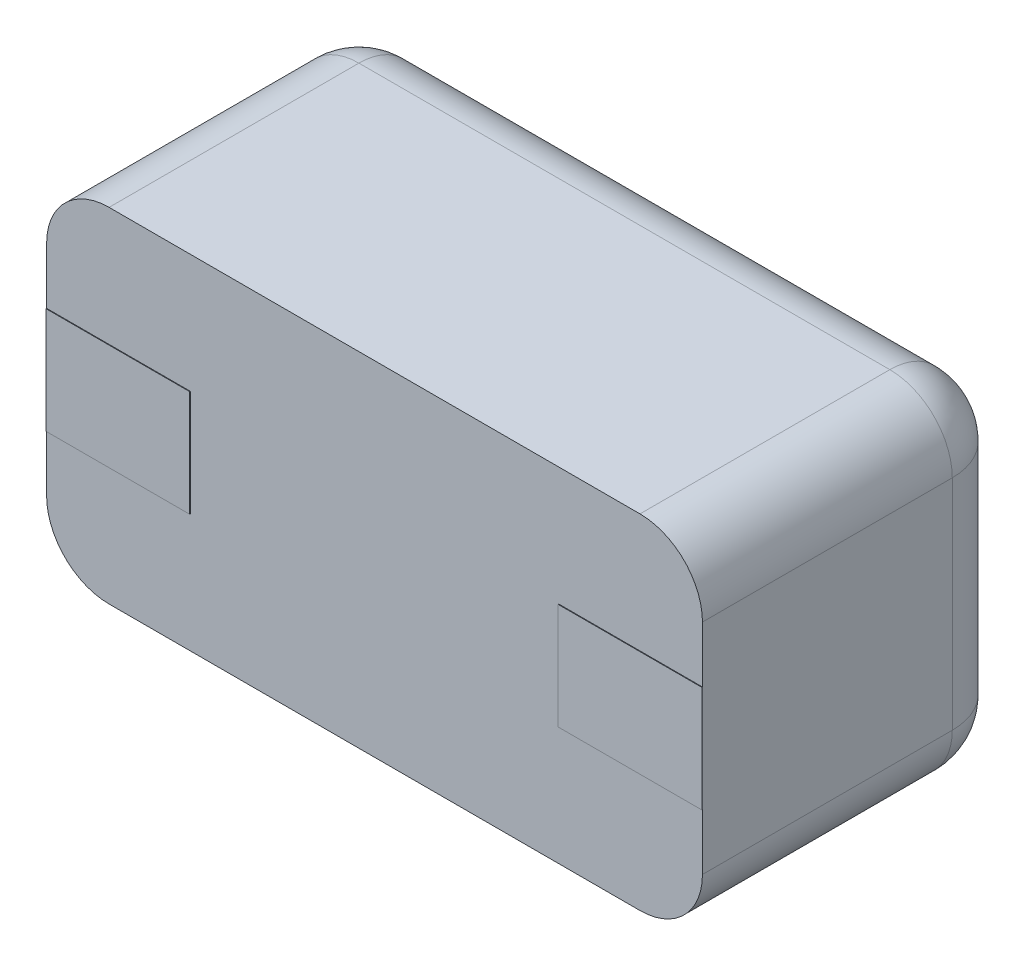
ISO-10303-21;
HEADER;
FILE_DESCRIPTION(('STEP AP214'),'2;1');
FILE_NAME('part.step','',(''),(''),'','','');
FILE_SCHEMA(('AUTOMOTIVE_DESIGN { 1 0 10303 214 1 1 1 1 }'));
ENDSEC;
DATA;
#1=APPLICATION_CONTEXT('core data for automotive mechanical design processes');
#2=APPLICATION_PROTOCOL_DEFINITION('international standard','automotive_design',2000,#1);
#3=PRODUCT_CONTEXT('',#1,'mechanical');
#4=PRODUCT('Part','Part','',(#3));
#5=PRODUCT_RELATED_PRODUCT_CATEGORY('part','',(#4));
#6=PRODUCT_DEFINITION_FORMATION('','',#4);
#7=PRODUCT_DEFINITION_CONTEXT('part definition',#1,'design');
#8=PRODUCT_DEFINITION('design','',#6,#7);
#9=PRODUCT_DEFINITION_SHAPE('','',#8);
#10=(LENGTH_UNIT() NAMED_UNIT(*) SI_UNIT(.MILLI.,.METRE.));
#11=(NAMED_UNIT(*) PLANE_ANGLE_UNIT() SI_UNIT($,.RADIAN.));
#12=(NAMED_UNIT(*) SI_UNIT($,.STERADIAN.) SOLID_ANGLE_UNIT());
#13=UNCERTAINTY_MEASURE_WITH_UNIT(LENGTH_MEASURE(1.E-05),#10,'distance_accuracy_value','');
#14=(GEOMETRIC_REPRESENTATION_CONTEXT(3) GLOBAL_UNCERTAINTY_ASSIGNED_CONTEXT((#13)) GLOBAL_UNIT_ASSIGNED_CONTEXT((#10,
#11,#12)) REPRESENTATION_CONTEXT('',''));
#15=CARTESIAN_POINT('',(0.,0.,0.));
#16=DIRECTION('',(0.,0.,1.));
#17=DIRECTION('',(1.,0.,0.));
#18=AXIS2_PLACEMENT_3D('',#15,#16,#17);
#19=CARTESIAN_POINT('',(8.2,0.,5.01));
#20=DIRECTION('',(-1.,0.,0.));
#21=DIRECTION('',(0.,0.,1.));
#22=AXIS2_PLACEMENT_3D('',#19,#20,#21);
#23=PLANE('',#22);
#24=DIRECTION('',(0.,1.,0.));
#25=VECTOR('',#24,1.);
#26=CARTESIAN_POINT('',(8.2,0.,5.));
#27=LINE('',#26,#25);
#28=CARTESIAN_POINT('',(8.2,1.9,5.));
#29=VERTEX_POINT('',#28);
#30=CARTESIAN_POINT('',(8.2,3.6,5.));
#31=VERTEX_POINT('',#30);
#32=EDGE_CURVE('E113',#29,#31,#27,.T.);
#33=ORIENTED_EDGE('',*,*,#32,.F.);
#34=DIRECTION('',(0.,0.,-1.));
#35=VECTOR('',#34,1.);
#36=CARTESIAN_POINT('',(8.2,1.9,5.01));
#37=LINE('',#36,#35);
#38=CARTESIAN_POINT('',(8.2,1.9,5.01));
#39=VERTEX_POINT('',#38);
#40=EDGE_CURVE('E12',#39,#29,#37,.T.);
#41=ORIENTED_EDGE('',*,*,#40,.F.);
#42=DIRECTION('',(0.,1.,0.));
#43=VECTOR('',#42,1.);
#44=CARTESIAN_POINT('',(8.2,0.,5.01));
#45=LINE('',#44,#43);
#46=CARTESIAN_POINT('',(8.2,3.6,5.01));
#47=VERTEX_POINT('',#46);
#48=EDGE_CURVE('E107',#39,#47,#45,.T.);
#49=ORIENTED_EDGE('',*,*,#48,.T.);
#50=DIRECTION('',(0.,0.,-1.));
#51=VECTOR('',#50,1.);
#52=CARTESIAN_POINT('',(8.2,3.6,5.01));
#53=LINE('',#52,#51);
#54=EDGE_CURVE('E88',#47,#31,#53,.T.);
#55=ORIENTED_EDGE('',*,*,#54,.T.);
#56=EDGE_LOOP('',(#33,#41,#49,#55));
#57=FACE_BOUND('',#56,.T.);
#58=ADVANCED_FACE('F50',(#57),#23,.T.);
#59=CARTESIAN_POINT('',(0.,1.90000000000001,5.01));
#60=DIRECTION('',(0.,-1.,0.));
#61=DIRECTION('',(1.,0.,0.));
#62=AXIS2_PLACEMENT_3D('',#59,#60,#61);
#63=PLANE('',#62);
#64=DIRECTION('',(-1.,0.,0.));
#65=VECTOR('',#64,1.);
#66=CARTESIAN_POINT('',(0.,1.90000000000001,5.));
#67=LINE('',#66,#65);
#68=CARTESIAN_POINT('',(10.5,1.89999999999999,5.));
#69=VERTEX_POINT('',#68);
#70=EDGE_CURVE('E101',#69,#29,#67,.T.);
#71=ORIENTED_EDGE('',*,*,#70,.F.);
#72=DIRECTION('',(0.,0.,-1.));
#73=VECTOR('',#72,1.);
#74=CARTESIAN_POINT('',(10.5,1.89999999999999,5.01));
#75=LINE('',#74,#73);
#76=CARTESIAN_POINT('',(10.5,1.89999999999999,5.01));
#77=VERTEX_POINT('',#76);
#78=EDGE_CURVE('E58',#77,#69,#75,.T.);
#79=ORIENTED_EDGE('',*,*,#78,.F.);
#80=DIRECTION('',(-1.,0.,0.));
#81=VECTOR('',#80,1.);
#82=CARTESIAN_POINT('',(0.,1.90000000000001,5.01));
#83=LINE('',#82,#81);
#84=EDGE_CURVE('E99',#77,#39,#83,.T.);
#85=ORIENTED_EDGE('',*,*,#84,.T.);
#86=ORIENTED_EDGE('',*,*,#40,.T.);
#87=EDGE_LOOP('',(#71,#79,#85,#86));
#88=FACE_BOUND('',#87,.T.);
#89=ADVANCED_FACE('F97',(#88),#63,.T.);
#90=CARTESIAN_POINT('',(10.5,0.,5.01));
#91=DIRECTION('',(-1.,0.,0.));
#92=DIRECTION('',(0.,0.,1.));
#93=AXIS2_PLACEMENT_3D('',#90,#91,#92);
#94=PLANE('',#93);
#95=DIRECTION('',(0.,1.,0.));
#96=VECTOR('',#95,1.);
#97=CARTESIAN_POINT('',(10.5,0.,5.));
#98=LINE('',#97,#96);
#99=CARTESIAN_POINT('',(10.5,3.59999999999999,5.));
#100=VERTEX_POINT('',#99);
#101=EDGE_CURVE('E81',#69,#100,#98,.T.);
#102=ORIENTED_EDGE('',*,*,#101,.T.);
#103=DIRECTION('',(0.,0.,-1.));
#104=VECTOR('',#103,1.);
#105=CARTESIAN_POINT('',(10.5,3.59999999999999,5.01));
#106=LINE('',#105,#104);
#107=CARTESIAN_POINT('',(10.5,3.59999999999999,5.01));
#108=VERTEX_POINT('',#107);
#109=EDGE_CURVE('E102',#108,#100,#106,.T.);
#110=ORIENTED_EDGE('',*,*,#109,.F.);
#111=DIRECTION('',(0.,1.,0.));
#112=VECTOR('',#111,1.);
#113=CARTESIAN_POINT('',(10.5,0.,5.01));
#114=LINE('',#113,#112);
#115=EDGE_CURVE('E103',#77,#108,#114,.T.);
#116=ORIENTED_EDGE('',*,*,#115,.F.);
#117=ORIENTED_EDGE('',*,*,#78,.T.);
#118=EDGE_LOOP('',(#102,#110,#116,#117));
#119=FACE_BOUND('',#118,.T.);
#120=ADVANCED_FACE('F104',(#119),#94,.F.);
#121=CARTESIAN_POINT('',(0.,3.60000000000001,5.01));
#122=DIRECTION('',(0.,-1.,0.));
#123=DIRECTION('',(1.,0.,0.));
#124=AXIS2_PLACEMENT_3D('',#121,#122,#123);
#125=PLANE('',#124);
#126=DIRECTION('',(-1.,0.,0.));
#127=VECTOR('',#126,1.);
#128=CARTESIAN_POINT('',(0.,3.60000000000001,5.));
#129=LINE('',#128,#127);
#130=EDGE_CURVE('E109',#100,#31,#129,.T.);
#131=ORIENTED_EDGE('',*,*,#130,.T.);
#132=ORIENTED_EDGE('',*,*,#54,.F.);
#133=DIRECTION('',(-1.,0.,0.));
#134=VECTOR('',#133,1.);
#135=CARTESIAN_POINT('',(0.,3.60000000000001,5.01));
#136=LINE('',#135,#134);
#137=EDGE_CURVE('E66',#108,#47,#136,.T.);
#138=ORIENTED_EDGE('',*,*,#137,.F.);
#139=ORIENTED_EDGE('',*,*,#109,.T.);
#140=EDGE_LOOP('',(#131,#132,#138,#139));
#141=FACE_BOUND('',#140,.T.);
#142=ADVANCED_FACE('F122',(#141),#125,.F.);
#143=CARTESIAN_POINT('',(0.,0.,5.01));
#144=DIRECTION('',(0.,0.,1.));
#145=DIRECTION('',(1.,0.,0.));
#146=AXIS2_PLACEMENT_3D('',#143,#144,#145);
#147=PLANE('',#146);
#148=ORIENTED_EDGE('',*,*,#48,.F.);
#149=ORIENTED_EDGE('',*,*,#84,.F.);
#150=ORIENTED_EDGE('',*,*,#115,.T.);
#151=ORIENTED_EDGE('',*,*,#137,.T.);
#152=EDGE_LOOP('',(#148,#149,#150,#151));
#153=FACE_BOUND('',#152,.T.);
#154=ADVANCED_FACE('F106',(#153),#147,.T.);
#155=CARTESIAN_POINT('',(0.,0.,5.));
#156=DIRECTION('',(0.,0.,1.));
#157=DIRECTION('',(1.,0.,0.));
#158=AXIS2_PLACEMENT_3D('',#155,#156,#157);
#159=PLANE('',#158);
#160=ORIENTED_EDGE('',*,*,#32,.T.);
#161=ORIENTED_EDGE('',*,*,#130,.F.);
#162=ORIENTED_EDGE('',*,*,#101,.F.);
#163=ORIENTED_EDGE('',*,*,#70,.T.);
#164=EDGE_LOOP('',(#160,#161,#162,#163));
#165=FACE_BOUND('',#164,.T.);
#166=ADVANCED_FACE('F124',(#165),#159,.F.);
#167=CLOSED_SHELL('',(#58,#89,#120,#142,#154,#166));
#168=MANIFOLD_SOLID_BREP('B2',#167);
#169=CARTESIAN_POINT('',(0.,0.,5.01));
#170=DIRECTION('',(1.,0.,0.));
#171=DIRECTION('',(0.,0.,-1.));
#172=AXIS2_PLACEMENT_3D('',#169,#170,#171);
#173=PLANE('',#172);
#174=DIRECTION('',(0.,-1.,0.));
#175=VECTOR('',#174,1.);
#176=CARTESIAN_POINT('',(0.,0.,5.));
#177=LINE('',#176,#175);
#178=CARTESIAN_POINT('',(0.,3.6,5.));
#179=VERTEX_POINT('',#178);
#180=CARTESIAN_POINT('',(0.,1.9,5.));
#181=VERTEX_POINT('',#180);
#182=EDGE_CURVE('E255',#179,#181,#177,.T.);
#183=ORIENTED_EDGE('',*,*,#182,.T.);
#184=DIRECTION('',(0.,0.,-1.));
#185=VECTOR('',#184,1.);
#186=CARTESIAN_POINT('',(0.,1.9,5.01));
#187=LINE('',#186,#185);
#188=CARTESIAN_POINT('',(0.,1.9,5.01));
#189=VERTEX_POINT('',#188);
#190=EDGE_CURVE('E48',#189,#181,#187,.T.);
#191=ORIENTED_EDGE('',*,*,#190,.F.);
#192=DIRECTION('',(0.,-1.,0.));
#193=VECTOR('',#192,1.);
#194=CARTESIAN_POINT('',(0.,0.,5.01));
#195=LINE('',#194,#193);
#196=CARTESIAN_POINT('',(0.,3.6,5.01));
#197=VERTEX_POINT('',#196);
#198=EDGE_CURVE('E241',#197,#189,#195,.T.);
#199=ORIENTED_EDGE('',*,*,#198,.F.);
#200=DIRECTION('',(0.,0.,-1.));
#201=VECTOR('',#200,1.);
#202=CARTESIAN_POINT('',(0.,3.6,5.01));
#203=LINE('',#202,#201);
#204=EDGE_CURVE('E208',#197,#179,#203,.T.);
#205=ORIENTED_EDGE('',*,*,#204,.T.);
#206=EDGE_LOOP('',(#183,#191,#199,#205));
#207=FACE_BOUND('',#206,.T.);
#208=ADVANCED_FACE('F192',(#207),#173,.F.);
#209=CARTESIAN_POINT('',(0.,1.9,5.01));
#210=DIRECTION('',(0.,1.,0.));
#211=DIRECTION('',(0.,0.,1.));
#212=AXIS2_PLACEMENT_3D('',#209,#210,#211);
#213=PLANE('',#212);
#214=DIRECTION('',(1.,0.,0.));
#215=VECTOR('',#214,1.);
#216=CARTESIAN_POINT('',(0.,1.9,5.));
#217=LINE('',#216,#215);
#218=CARTESIAN_POINT('',(2.3,1.9,5.));
#219=VERTEX_POINT('',#218);
#220=EDGE_CURVE('E246',#181,#219,#217,.T.);
#221=ORIENTED_EDGE('',*,*,#220,.T.);
#222=DIRECTION('',(0.,0.,-1.));
#223=VECTOR('',#222,1.);
#224=CARTESIAN_POINT('',(2.3,1.9,5.01));
#225=LINE('',#224,#223);
#226=CARTESIAN_POINT('',(2.3,1.9,5.01));
#227=VERTEX_POINT('',#226);
#228=EDGE_CURVE('E200',#227,#219,#225,.T.);
#229=ORIENTED_EDGE('',*,*,#228,.F.);
#230=DIRECTION('',(1.,0.,0.));
#231=VECTOR('',#230,1.);
#232=CARTESIAN_POINT('',(0.,1.9,5.01));
#233=LINE('',#232,#231);
#234=EDGE_CURVE('E234',#189,#227,#233,.T.);
#235=ORIENTED_EDGE('',*,*,#234,.F.);
#236=ORIENTED_EDGE('',*,*,#190,.T.);
#237=EDGE_LOOP('',(#221,#229,#235,#236));
#238=FACE_BOUND('',#237,.T.);
#239=ADVANCED_FACE('F245',(#238),#213,.F.);
#240=CARTESIAN_POINT('',(2.3,0.,5.01));
#241=DIRECTION('',(-1.,0.,0.));
#242=DIRECTION('',(0.,-1.,0.));
#243=AXIS2_PLACEMENT_3D('',#240,#241,#242);
#244=PLANE('',#243);
#245=DIRECTION('',(0.,1.,0.));
#246=VECTOR('',#245,1.);
#247=CARTESIAN_POINT('',(2.3,0.,5.));
#248=LINE('',#247,#246);
#249=CARTESIAN_POINT('',(2.3,3.6,5.));
#250=VERTEX_POINT('',#249);
#251=EDGE_CURVE('E258',#219,#250,#248,.T.);
#252=ORIENTED_EDGE('',*,*,#251,.T.);
#253=DIRECTION('',(0.,0.,-1.));
#254=VECTOR('',#253,1.);
#255=CARTESIAN_POINT('',(2.3,3.6,5.01));
#256=LINE('',#255,#254);
#257=CARTESIAN_POINT('',(2.3,3.6,5.01));
#258=VERTEX_POINT('',#257);
#259=EDGE_CURVE('E223',#258,#250,#256,.T.);
#260=ORIENTED_EDGE('',*,*,#259,.F.);
#261=DIRECTION('',(0.,1.,0.));
#262=VECTOR('',#261,1.);
#263=CARTESIAN_POINT('',(2.3,0.,5.01));
#264=LINE('',#263,#262);
#265=EDGE_CURVE('E240',#227,#258,#264,.T.);
#266=ORIENTED_EDGE('',*,*,#265,.F.);
#267=ORIENTED_EDGE('',*,*,#228,.T.);
#268=EDGE_LOOP('',(#252,#260,#266,#267));
#269=FACE_BOUND('',#268,.T.);
#270=ADVANCED_FACE('F249',(#269),#244,.F.);
#271=CARTESIAN_POINT('',(0.,3.6,5.01));
#272=DIRECTION('',(0.,1.,0.));
#273=DIRECTION('',(0.,0.,1.));
#274=AXIS2_PLACEMENT_3D('',#271,#272,#273);
#275=PLANE('',#274);
#276=DIRECTION('',(1.,0.,0.));
#277=VECTOR('',#276,1.);
#278=CARTESIAN_POINT('',(0.,3.6,5.));
#279=LINE('',#278,#277);
#280=EDGE_CURVE('E260',#179,#250,#279,.T.);
#281=ORIENTED_EDGE('',*,*,#280,.F.);
#282=ORIENTED_EDGE('',*,*,#204,.F.);
#283=DIRECTION('',(1.,0.,0.));
#284=VECTOR('',#283,1.);
#285=CARTESIAN_POINT('',(0.,3.6,5.01));
#286=LINE('',#285,#284);
#287=EDGE_CURVE('E250',#197,#258,#286,.T.);
#288=ORIENTED_EDGE('',*,*,#287,.T.);
#289=ORIENTED_EDGE('',*,*,#259,.T.);
#290=EDGE_LOOP('',(#281,#282,#288,#289));
#291=FACE_BOUND('',#290,.T.);
#292=ADVANCED_FACE('F266',(#291),#275,.T.);
#293=CARTESIAN_POINT('',(0.,0.,5.01));
#294=DIRECTION('',(0.,0.,1.));
#295=DIRECTION('',(1.,0.,0.));
#296=AXIS2_PLACEMENT_3D('',#293,#294,#295);
#297=PLANE('',#296);
#298=ORIENTED_EDGE('',*,*,#198,.T.);
#299=ORIENTED_EDGE('',*,*,#234,.T.);
#300=ORIENTED_EDGE('',*,*,#265,.T.);
#301=ORIENTED_EDGE('',*,*,#287,.F.);
#302=EDGE_LOOP('',(#298,#299,#300,#301));
#303=FACE_BOUND('',#302,.T.);
#304=ADVANCED_FACE('F237',(#303),#297,.T.);
#305=CARTESIAN_POINT('',(0.,0.,5.));
#306=DIRECTION('',(0.,0.,1.));
#307=DIRECTION('',(1.,0.,0.));
#308=AXIS2_PLACEMENT_3D('',#305,#306,#307);
#309=PLANE('',#308);
#310=ORIENTED_EDGE('',*,*,#182,.F.);
#311=ORIENTED_EDGE('',*,*,#280,.T.);
#312=ORIENTED_EDGE('',*,*,#251,.F.);
#313=ORIENTED_EDGE('',*,*,#220,.F.);
#314=EDGE_LOOP('',(#310,#311,#312,#313));
#315=FACE_BOUND('',#314,.T.);
#316=ADVANCED_FACE('F265',(#315),#309,.F.);
#317=CLOSED_SHELL('',(#208,#239,#270,#292,#304,#316));
#318=MANIFOLD_SOLID_BREP('B6',#317);
#319=CARTESIAN_POINT('',(0.,0.,5.));
#320=DIRECTION('',(1.,0.,0.));
#321=DIRECTION('',(0.,0.,-1.));
#322=AXIS2_PLACEMENT_3D('',#319,#320,#321);
#323=PLANE('',#322);
#324=DIRECTION('',(0.,-1.,0.));
#325=VECTOR('',#324,1.);
#326=CARTESIAN_POINT('',(0.,0.,5.));
#327=LINE('',#326,#325);
#328=CARTESIAN_POINT('',(0.,4.5,5.));
#329=VERTEX_POINT('',#328);
#330=CARTESIAN_POINT('',(0.,1.,5.));
#331=VERTEX_POINT('',#330);
#332=EDGE_CURVE('E469',#329,#331,#327,.T.);
#333=ORIENTED_EDGE('',*,*,#332,.F.);
#334=DIRECTION('',(0.,0.,-1.));
#335=VECTOR('',#334,1.);
#336=CARTESIAN_POINT('',(0.,4.5,5.));
#337=LINE('',#336,#335);
#338=CARTESIAN_POINT('',(0.,4.5,1.));
#339=VERTEX_POINT('',#338);
#340=EDGE_CURVE('E463',#329,#339,#337,.T.);
#341=ORIENTED_EDGE('',*,*,#340,.T.);
#342=DIRECTION('',(0.,-1.,0.));
#343=VECTOR('',#342,1.);
#344=CARTESIAN_POINT('',(0.,0.,1.));
#345=LINE('',#344,#343);
#346=CARTESIAN_POINT('',(0.,1.,1.));
#347=VERTEX_POINT('',#346);
#348=EDGE_CURVE('E435',#339,#347,#345,.T.);
#349=ORIENTED_EDGE('',*,*,#348,.T.);
#350=DIRECTION('',(0.,0.,-1.));
#351=VECTOR('',#350,1.);
#352=CARTESIAN_POINT('',(0.,1.,5.));
#353=LINE('',#352,#351);
#354=EDGE_CURVE('E461',#347,#331,#353,.F.);
#355=ORIENTED_EDGE('',*,*,#354,.T.);
#356=EDGE_LOOP('',(#333,#341,#349,#355));
#357=FACE_BOUND('',#356,.T.);
#358=ADVANCED_FACE('F325',(#357),#323,.F.);
#359=CARTESIAN_POINT('',(0.,0.,5.));
#360=DIRECTION('',(0.,1.,0.));
#361=DIRECTION('',(0.,0.,1.));
#362=AXIS2_PLACEMENT_3D('',#359,#360,#361);
#363=PLANE('',#362);
#364=DIRECTION('',(1.,0.,0.));
#365=VECTOR('',#364,1.);
#366=CARTESIAN_POINT('',(0.,0.,5.));
#367=LINE('',#366,#365);
#368=CARTESIAN_POINT('',(1.,0.,5.));
#369=VERTEX_POINT('',#368);
#370=CARTESIAN_POINT('',(9.5,0.,5.));
#371=VERTEX_POINT('',#370);
#372=EDGE_CURVE('E691',#369,#371,#367,.T.);
#373=ORIENTED_EDGE('',*,*,#372,.F.);
#374=DIRECTION('',(0.,0.,-1.));
#375=VECTOR('',#374,1.);
#376=CARTESIAN_POINT('',(1.,0.,5.));
#377=LINE('',#376,#375);
#378=CARTESIAN_POINT('',(0.999999999999999,0.,1.));
#379=VERTEX_POINT('',#378);
#380=EDGE_CURVE('E190',#369,#379,#377,.T.);
#381=ORIENTED_EDGE('',*,*,#380,.T.);
#382=DIRECTION('',(1.,0.,0.));
#383=VECTOR('',#382,1.);
#384=CARTESIAN_POINT('',(10.5,0.,1.));
#385=LINE('',#384,#383);
#386=CARTESIAN_POINT('',(9.5,0.,1.));
#387=VERTEX_POINT('',#386);
#388=EDGE_CURVE('E504',#379,#387,#385,.T.);
#389=ORIENTED_EDGE('',*,*,#388,.T.);
#390=DIRECTION('',(0.,0.,-1.));
#391=VECTOR('',#390,1.);
#392=CARTESIAN_POINT('',(9.5,0.,5.));
#393=LINE('',#392,#391);
#394=EDGE_CURVE('E334',#387,#371,#393,.F.);
#395=ORIENTED_EDGE('',*,*,#394,.T.);
#396=EDGE_LOOP('',(#373,#381,#389,#395));
#397=FACE_BOUND('',#396,.T.);
#398=ADVANCED_FACE('F547',(#397),#363,.F.);
#399=CARTESIAN_POINT('',(10.5,0.,5.));
#400=DIRECTION('',(-1.,0.,0.));
#401=DIRECTION('',(0.,0.,1.));
#402=AXIS2_PLACEMENT_3D('',#399,#400,#401);
#403=PLANE('',#402);
#404=DIRECTION('',(0.,1.,0.));
#405=VECTOR('',#404,1.);
#406=CARTESIAN_POINT('',(10.5,5.5,1.));
#407=LINE('',#406,#405);
#408=CARTESIAN_POINT('',(10.5,1.,1.));
#409=VERTEX_POINT('',#408);
#410=CARTESIAN_POINT('',(10.5,4.5,1.));
#411=VERTEX_POINT('',#410);
#412=EDGE_CURVE('E410',#409,#411,#407,.T.);
#413=ORIENTED_EDGE('',*,*,#412,.T.);
#414=DIRECTION('',(0.,0.,-1.));
#415=VECTOR('',#414,1.);
#416=CARTESIAN_POINT('',(10.5,4.5,5.));
#417=LINE('',#416,#415);
#418=CARTESIAN_POINT('',(10.5,4.5,5.));
#419=VERTEX_POINT('',#418);
#420=EDGE_CURVE('E452',#411,#419,#417,.F.);
#421=ORIENTED_EDGE('',*,*,#420,.T.);
#422=DIRECTION('',(0.,1.,0.));
#423=VECTOR('',#422,1.);
#424=CARTESIAN_POINT('',(10.5,0.,5.));
#425=LINE('',#424,#423);
#426=CARTESIAN_POINT('',(10.5,1.,5.));
#427=VERTEX_POINT('',#426);
#428=EDGE_CURVE('E494',#427,#419,#425,.T.);
#429=ORIENTED_EDGE('',*,*,#428,.F.);
#430=DIRECTION('',(0.,0.,-1.));
#431=VECTOR('',#430,1.);
#432=CARTESIAN_POINT('',(10.5,1.,5.));
#433=LINE('',#432,#431);
#434=EDGE_CURVE('E450',#427,#409,#433,.T.);
#435=ORIENTED_EDGE('',*,*,#434,.T.);
#436=EDGE_LOOP('',(#413,#421,#429,#435));
#437=FACE_BOUND('',#436,.T.);
#438=ADVANCED_FACE('F514',(#437),#403,.F.);
#439=CARTESIAN_POINT('',(0.,5.5,5.));
#440=DIRECTION('',(0.,-1.,0.));
#441=DIRECTION('',(0.,0.,-1.));
#442=AXIS2_PLACEMENT_3D('',#439,#440,#441);
#443=PLANE('',#442);
#444=DIRECTION('',(-1.,0.,0.));
#445=VECTOR('',#444,1.);
#446=CARTESIAN_POINT('',(0.,5.5,5.));
#447=LINE('',#446,#445);
#448=CARTESIAN_POINT('',(9.5,5.5,5.));
#449=VERTEX_POINT('',#448);
#450=CARTESIAN_POINT('',(1.,5.5,5.));
#451=VERTEX_POINT('',#450);
#452=EDGE_CURVE('E491',#449,#451,#447,.T.);
#453=ORIENTED_EDGE('',*,*,#452,.F.);
#454=DIRECTION('',(0.,0.,-1.));
#455=VECTOR('',#454,1.);
#456=CARTESIAN_POINT('',(9.5,5.5,5.));
#457=LINE('',#456,#455);
#458=CARTESIAN_POINT('',(9.5,5.5,1.));
#459=VERTEX_POINT('',#458);
#460=EDGE_CURVE('E448',#449,#459,#457,.T.);
#461=ORIENTED_EDGE('',*,*,#460,.T.);
#462=DIRECTION('',(-1.,0.,0.));
#463=VECTOR('',#462,1.);
#464=CARTESIAN_POINT('',(0.,5.5,1.));
#465=LINE('',#464,#463);
#466=CARTESIAN_POINT('',(1.,5.5,1.));
#467=VERTEX_POINT('',#466);
#468=EDGE_CURVE('E500',#459,#467,#465,.T.);
#469=ORIENTED_EDGE('',*,*,#468,.T.);
#470=DIRECTION('',(0.,0.,-1.));
#471=VECTOR('',#470,1.);
#472=CARTESIAN_POINT('',(1.,5.5,5.));
#473=LINE('',#472,#471);
#474=EDGE_CURVE('E440',#467,#451,#473,.F.);
#475=ORIENTED_EDGE('',*,*,#474,.T.);
#476=EDGE_LOOP('',(#453,#461,#469,#475));
#477=FACE_BOUND('',#476,.T.);
#478=ADVANCED_FACE('F530',(#477),#443,.F.);
#479=CARTESIAN_POINT('',(0.,0.,5.));
#480=DIRECTION('',(0.,0.,-1.));
#481=DIRECTION('',(-1.,0.,0.));
#482=AXIS2_PLACEMENT_3D('',#479,#480,#481);
#483=PLANE('',#482);
#484=ORIENTED_EDGE('',*,*,#428,.T.);
#485=CARTESIAN_POINT('',(9.5,4.5,5.));
#486=DIRECTION('',(0.,0.,-1.));
#487=DIRECTION('',(-1.,0.,0.));
#488=AXIS2_PLACEMENT_3D('',#485,#486,#487);
#489=CIRCLE('',#488,1.);
#490=EDGE_CURVE('E459',#419,#449,#489,.F.);
#491=ORIENTED_EDGE('',*,*,#490,.T.);
#492=ORIENTED_EDGE('',*,*,#452,.T.);
#493=CARTESIAN_POINT('',(1.,4.5,5.));
#494=DIRECTION('',(0.,0.,-1.));
#495=DIRECTION('',(-1.,0.,0.));
#496=AXIS2_PLACEMENT_3D('',#493,#494,#495);
#497=CIRCLE('',#496,1.);
#498=EDGE_CURVE('E457',#451,#329,#497,.F.);
#499=ORIENTED_EDGE('',*,*,#498,.T.);
#500=ORIENTED_EDGE('',*,*,#332,.T.);
#501=CARTESIAN_POINT('',(1.,1.,5.));
#502=DIRECTION('',(0.,0.,-1.));
#503=DIRECTION('',(-1.,0.,0.));
#504=AXIS2_PLACEMENT_3D('',#501,#502,#503);
#505=CIRCLE('',#504,1.);
#506=EDGE_CURVE('E348',#331,#369,#505,.F.);
#507=ORIENTED_EDGE('',*,*,#506,.T.);
#508=ORIENTED_EDGE('',*,*,#372,.T.);
#509=CARTESIAN_POINT('',(9.5,1.,5.));
#510=DIRECTION('',(0.,0.,-1.));
#511=DIRECTION('',(-1.,0.,0.));
#512=AXIS2_PLACEMENT_3D('',#509,#510,#511);
#513=CIRCLE('',#512,1.);
#514=EDGE_CURVE('E454',#371,#427,#513,.F.);
#515=ORIENTED_EDGE('',*,*,#514,.T.);
#516=EDGE_LOOP('',(#484,#491,#492,#499,#500,#507,#508,#515));
#517=FACE_BOUND('',#516,.T.);
#518=ADVANCED_FACE('F651',(#517),#483,.F.);
#519=CARTESIAN_POINT('',(0.,0.,0.));
#520=DIRECTION('',(0.,0.,-1.));
#521=DIRECTION('',(-1.,0.,0.));
#522=AXIS2_PLACEMENT_3D('',#519,#520,#521);
#523=PLANE('',#522);
#524=DIRECTION('',(1.,0.,0.));
#525=VECTOR('',#524,1.);
#526=CARTESIAN_POINT('',(0.,1.,0.));
#527=LINE('',#526,#525);
#528=CARTESIAN_POINT('',(9.5,1.,0.));
#529=VERTEX_POINT('',#528);
#530=CARTESIAN_POINT('',(1.,1.,0.));
#531=VERTEX_POINT('',#530);
#532=EDGE_CURVE('E423',#529,#531,#527,.F.);
#533=ORIENTED_EDGE('',*,*,#532,.T.);
#534=DIRECTION('',(0.,-1.,0.));
#535=VECTOR('',#534,1.);
#536=CARTESIAN_POINT('',(1.,5.5,0.));
#537=LINE('',#536,#535);
#538=CARTESIAN_POINT('',(1.,4.5,0.));
#539=VERTEX_POINT('',#538);
#540=EDGE_CURVE('E489',#531,#539,#537,.F.);
#541=ORIENTED_EDGE('',*,*,#540,.T.);
#542=DIRECTION('',(-1.,0.,0.));
#543=VECTOR('',#542,1.);
#544=CARTESIAN_POINT('',(10.5,4.5,0.));
#545=LINE('',#544,#543);
#546=CARTESIAN_POINT('',(9.5,4.5,0.));
#547=VERTEX_POINT('',#546);
#548=EDGE_CURVE('E426',#539,#547,#545,.F.);
#549=ORIENTED_EDGE('',*,*,#548,.T.);
#550=DIRECTION('',(0.,1.,0.));
#551=VECTOR('',#550,1.);
#552=CARTESIAN_POINT('',(9.5,0.,0.));
#553=LINE('',#552,#551);
#554=EDGE_CURVE('E408',#547,#529,#553,.F.);
#555=ORIENTED_EDGE('',*,*,#554,.T.);
#556=EDGE_LOOP('',(#533,#541,#549,#555));
#557=FACE_BOUND('',#556,.T.);
#558=ADVANCED_FACE('F421',(#557),#523,.T.);
#559=CARTESIAN_POINT('',(9.5,0.,1.));
#560=DIRECTION('',(0.,-1.,0.));
#561=DIRECTION('',(0.,0.,-1.));
#562=AXIS2_PLACEMENT_3D('',#559,#560,#561);
#563=CYLINDRICAL_SURFACE('',#562,1.);
#564=ORIENTED_EDGE('',*,*,#554,.F.);
#565=CARTESIAN_POINT('',(9.5,4.5,1.));
#566=DIRECTION('',(0.,-1.,0.));
#567=DIRECTION('',(0.,0.,-1.));
#568=AXIS2_PLACEMENT_3D('',#565,#566,#567);
#569=CIRCLE('',#568,1.);
#570=EDGE_CURVE('E414',#547,#411,#569,.T.);
#571=ORIENTED_EDGE('',*,*,#570,.T.);
#572=ORIENTED_EDGE('',*,*,#412,.F.);
#573=CARTESIAN_POINT('',(9.5,1.,1.));
#574=DIRECTION('',(0.,-1.,0.));
#575=DIRECTION('',(0.,0.,-1.));
#576=AXIS2_PLACEMENT_3D('',#573,#574,#575);
#577=CIRCLE('',#576,1.);
#578=EDGE_CURVE('E405',#409,#529,#577,.F.);
#579=ORIENTED_EDGE('',*,*,#578,.T.);
#580=EDGE_LOOP('',(#564,#571,#572,#579));
#581=FACE_BOUND('',#580,.T.);
#582=ADVANCED_FACE('F407',(#581),#563,.T.);
#583=CARTESIAN_POINT('',(0.,4.5,1.));
#584=DIRECTION('',(1.,0.,0.));
#585=DIRECTION('',(0.,0.,-1.));
#586=AXIS2_PLACEMENT_3D('',#583,#584,#585);
#587=CYLINDRICAL_SURFACE('',#586,1.);
#588=ORIENTED_EDGE('',*,*,#468,.F.);
#589=CARTESIAN_POINT('',(9.5,4.5,1.));
#590=DIRECTION('',(1.,0.,0.));
#591=DIRECTION('',(0.,0.,-1.));
#592=AXIS2_PLACEMENT_3D('',#589,#590,#591);
#593=CIRCLE('',#592,1.);
#594=EDGE_CURVE('E415',#459,#547,#593,.F.);
#595=ORIENTED_EDGE('',*,*,#594,.T.);
#596=ORIENTED_EDGE('',*,*,#548,.F.);
#597=CARTESIAN_POINT('',(1.,4.5,1.));
#598=DIRECTION('',(1.,0.,0.));
#599=DIRECTION('',(0.,0.,-1.));
#600=AXIS2_PLACEMENT_3D('',#597,#598,#599);
#601=CIRCLE('',#600,1.);
#602=EDGE_CURVE('E506',#539,#467,#601,.T.);
#603=ORIENTED_EDGE('',*,*,#602,.T.);
#604=EDGE_LOOP('',(#588,#595,#596,#603));
#605=FACE_BOUND('',#604,.T.);
#606=ADVANCED_FACE('F526',(#605),#587,.T.);
#607=CARTESIAN_POINT('',(0.,1.,1.));
#608=DIRECTION('',(-1.,0.,0.));
#609=DIRECTION('',(0.,0.,1.));
#610=AXIS2_PLACEMENT_3D('',#607,#608,#609);
#611=CYLINDRICAL_SURFACE('',#610,1.);
#612=ORIENTED_EDGE('',*,*,#388,.F.);
#613=CARTESIAN_POINT('',(1.,1.,1.));
#614=DIRECTION('',(-1.,0.,0.));
#615=DIRECTION('',(0.,0.,1.));
#616=AXIS2_PLACEMENT_3D('',#613,#614,#615);
#617=CIRCLE('',#616,1.);
#618=EDGE_CURVE('E434',#379,#531,#617,.F.);
#619=ORIENTED_EDGE('',*,*,#618,.T.);
#620=ORIENTED_EDGE('',*,*,#532,.F.);
#621=CARTESIAN_POINT('',(9.5,1.,1.));
#622=DIRECTION('',(-1.,0.,0.));
#623=DIRECTION('',(0.,0.,1.));
#624=AXIS2_PLACEMENT_3D('',#621,#622,#623);
#625=CIRCLE('',#624,1.);
#626=EDGE_CURVE('E432',#529,#387,#625,.T.);
#627=ORIENTED_EDGE('',*,*,#626,.T.);
#628=EDGE_LOOP('',(#612,#619,#620,#627));
#629=FACE_BOUND('',#628,.T.);
#630=ADVANCED_FACE('F431',(#629),#611,.T.);
#631=CARTESIAN_POINT('',(1.,0.,1.));
#632=DIRECTION('',(0.,1.,0.));
#633=DIRECTION('',(0.,0.,1.));
#634=AXIS2_PLACEMENT_3D('',#631,#632,#633);
#635=CYLINDRICAL_SURFACE('',#634,1.);
#636=ORIENTED_EDGE('',*,*,#348,.F.);
#637=CARTESIAN_POINT('',(1.,4.5,1.));
#638=DIRECTION('',(0.,1.,0.));
#639=DIRECTION('',(0.,0.,1.));
#640=AXIS2_PLACEMENT_3D('',#637,#638,#639);
#641=CIRCLE('',#640,1.);
#642=EDGE_CURVE('E438',#339,#539,#641,.F.);
#643=ORIENTED_EDGE('',*,*,#642,.T.);
#644=ORIENTED_EDGE('',*,*,#540,.F.);
#645=CARTESIAN_POINT('',(1.,1.,1.));
#646=DIRECTION('',(0.,1.,0.));
#647=DIRECTION('',(0.,0.,1.));
#648=AXIS2_PLACEMENT_3D('',#645,#646,#647);
#649=CIRCLE('',#648,1.);
#650=EDGE_CURVE('E443',#531,#347,#649,.T.);
#651=ORIENTED_EDGE('',*,*,#650,.T.);
#652=EDGE_LOOP('',(#636,#643,#644,#651));
#653=FACE_BOUND('',#652,.T.);
#654=ADVANCED_FACE('F487',(#653),#635,.T.);
#655=CARTESIAN_POINT('',(9.5,4.5,5.));
#656=DIRECTION('',(0.,0.,-1.));
#657=DIRECTION('',(-1.,0.,0.));
#658=AXIS2_PLACEMENT_3D('',#655,#656,#657);
#659=CYLINDRICAL_SURFACE('',#658,1.);
#660=ORIENTED_EDGE('',*,*,#490,.F.);
#661=ORIENTED_EDGE('',*,*,#420,.F.);
#662=CARTESIAN_POINT('',(9.5,4.5,1.));
#663=DIRECTION('',(0.,0.,-1.));
#664=DIRECTION('',(-1.,0.,0.));
#665=AXIS2_PLACEMENT_3D('',#662,#663,#664);
#666=CIRCLE('',#665,1.);
#667=EDGE_CURVE('E466',#459,#411,#666,.T.);
#668=ORIENTED_EDGE('',*,*,#667,.F.);
#669=ORIENTED_EDGE('',*,*,#460,.F.);
#670=EDGE_LOOP('',(#660,#661,#668,#669));
#671=FACE_BOUND('',#670,.T.);
#672=ADVANCED_FACE('F521',(#671),#659,.T.);
#673=CARTESIAN_POINT('',(9.5,4.5,1.));
#674=DIRECTION('',(0.,0.,1.));
#675=DIRECTION('',(1.,0.,0.));
#676=AXIS2_PLACEMENT_3D('',#673,#674,#675);
#677=SPHERICAL_SURFACE('',#676,1.);
#678=ORIENTED_EDGE('',*,*,#667,.T.);
#679=ORIENTED_EDGE('',*,*,#570,.F.);
#680=ORIENTED_EDGE('',*,*,#594,.F.);
#681=EDGE_LOOP('',(#678,#679,#680));
#682=FACE_BOUND('',#681,.T.);
#683=ADVANCED_FACE('F523',(#682),#677,.T.);
#684=CARTESIAN_POINT('',(1.,4.5,5.));
#685=DIRECTION('',(0.,0.,-1.));
#686=DIRECTION('',(-1.,0.,0.));
#687=AXIS2_PLACEMENT_3D('',#684,#685,#686);
#688=CYLINDRICAL_SURFACE('',#687,1.);
#689=ORIENTED_EDGE('',*,*,#498,.F.);
#690=ORIENTED_EDGE('',*,*,#474,.F.);
#691=CARTESIAN_POINT('',(1.,4.5,1.));
#692=DIRECTION('',(0.,0.,-1.));
#693=DIRECTION('',(-1.,0.,0.));
#694=AXIS2_PLACEMENT_3D('',#691,#692,#693);
#695=CIRCLE('',#694,1.);
#696=EDGE_CURVE('E470',#339,#467,#695,.T.);
#697=ORIENTED_EDGE('',*,*,#696,.F.);
#698=ORIENTED_EDGE('',*,*,#340,.F.);
#699=EDGE_LOOP('',(#689,#690,#697,#698));
#700=FACE_BOUND('',#699,.T.);
#701=ADVANCED_FACE('F533',(#700),#688,.T.);
#702=CARTESIAN_POINT('',(1.,4.5,1.));
#703=DIRECTION('',(0.,0.,1.));
#704=DIRECTION('',(1.,0.,0.));
#705=AXIS2_PLACEMENT_3D('',#702,#703,#704);
#706=SPHERICAL_SURFACE('',#705,1.);
#707=ORIENTED_EDGE('',*,*,#696,.T.);
#708=ORIENTED_EDGE('',*,*,#602,.F.);
#709=ORIENTED_EDGE('',*,*,#642,.F.);
#710=EDGE_LOOP('',(#707,#708,#709));
#711=FACE_BOUND('',#710,.T.);
#712=ADVANCED_FACE('F536',(#711),#706,.T.);
#713=CARTESIAN_POINT('',(1.,1.,5.));
#714=DIRECTION('',(0.,0.,-1.));
#715=DIRECTION('',(-1.,0.,0.));
#716=AXIS2_PLACEMENT_3D('',#713,#714,#715);
#717=CYLINDRICAL_SURFACE('',#716,1.);
#718=ORIENTED_EDGE('',*,*,#506,.F.);
#719=ORIENTED_EDGE('',*,*,#354,.F.);
#720=CARTESIAN_POINT('',(1.,1.,1.));
#721=DIRECTION('',(0.,0.,-1.));
#722=DIRECTION('',(-1.,0.,0.));
#723=AXIS2_PLACEMENT_3D('',#720,#721,#722);
#724=CIRCLE('',#723,1.);
#725=EDGE_CURVE('E472',#379,#347,#724,.T.);
#726=ORIENTED_EDGE('',*,*,#725,.F.);
#727=ORIENTED_EDGE('',*,*,#380,.F.);
#728=EDGE_LOOP('',(#718,#719,#726,#727));
#729=FACE_BOUND('',#728,.T.);
#730=ADVANCED_FACE('F481',(#729),#717,.T.);
#731=CARTESIAN_POINT('',(1.,1.,1.));
#732=DIRECTION('',(0.,0.,1.));
#733=DIRECTION('',(1.,0.,0.));
#734=AXIS2_PLACEMENT_3D('',#731,#732,#733);
#735=SPHERICAL_SURFACE('',#734,1.);
#736=ORIENTED_EDGE('',*,*,#650,.F.);
#737=ORIENTED_EDGE('',*,*,#618,.F.);
#738=ORIENTED_EDGE('',*,*,#725,.T.);
#739=EDGE_LOOP('',(#736,#737,#738));
#740=FACE_BOUND('',#739,.T.);
#741=ADVANCED_FACE('F477',(#740),#735,.T.);
#742=CARTESIAN_POINT('',(9.5,1.,5.));
#743=DIRECTION('',(0.,0.,-1.));
#744=DIRECTION('',(-1.,0.,0.));
#745=AXIS2_PLACEMENT_3D('',#742,#743,#744);
#746=CYLINDRICAL_SURFACE('',#745,1.);
#747=ORIENTED_EDGE('',*,*,#514,.F.);
#748=ORIENTED_EDGE('',*,*,#394,.F.);
#749=CARTESIAN_POINT('',(9.5,1.,1.));
#750=DIRECTION('',(0.,0.,-1.));
#751=DIRECTION('',(-1.,0.,0.));
#752=AXIS2_PLACEMENT_3D('',#749,#750,#751);
#753=CIRCLE('',#752,1.);
#754=EDGE_CURVE('E329',#409,#387,#753,.T.);
#755=ORIENTED_EDGE('',*,*,#754,.F.);
#756=ORIENTED_EDGE('',*,*,#434,.F.);
#757=EDGE_LOOP('',(#747,#748,#755,#756));
#758=FACE_BOUND('',#757,.T.);
#759=ADVANCED_FACE('F327',(#758),#746,.T.);
#760=CARTESIAN_POINT('',(9.5,1.,1.));
#761=DIRECTION('',(0.,0.,1.));
#762=DIRECTION('',(1.,0.,0.));
#763=AXIS2_PLACEMENT_3D('',#760,#761,#762);
#764=SPHERICAL_SURFACE('',#763,1.);
#765=ORIENTED_EDGE('',*,*,#626,.F.);
#766=ORIENTED_EDGE('',*,*,#578,.F.);
#767=ORIENTED_EDGE('',*,*,#754,.T.);
#768=EDGE_LOOP('',(#765,#766,#767));
#769=FACE_BOUND('',#768,.T.);
#770=ADVANCED_FACE('F437',(#769),#764,.T.);
#771=CLOSED_SHELL('',(#358,#398,#438,#478,#518,#558,#582,#606,#630,#654,#672,#683,#701,#712,
#730,#741,#759,#770));
#772=MANIFOLD_SOLID_BREP('B42',#771);
#773=ADVANCED_BREP_SHAPE_REPRESENTATION('',(#18,#168,#318,#772),#14);
#774=SHAPE_DEFINITION_REPRESENTATION(#9,#773);
ENDSEC;
END-ISO-10303-21;
